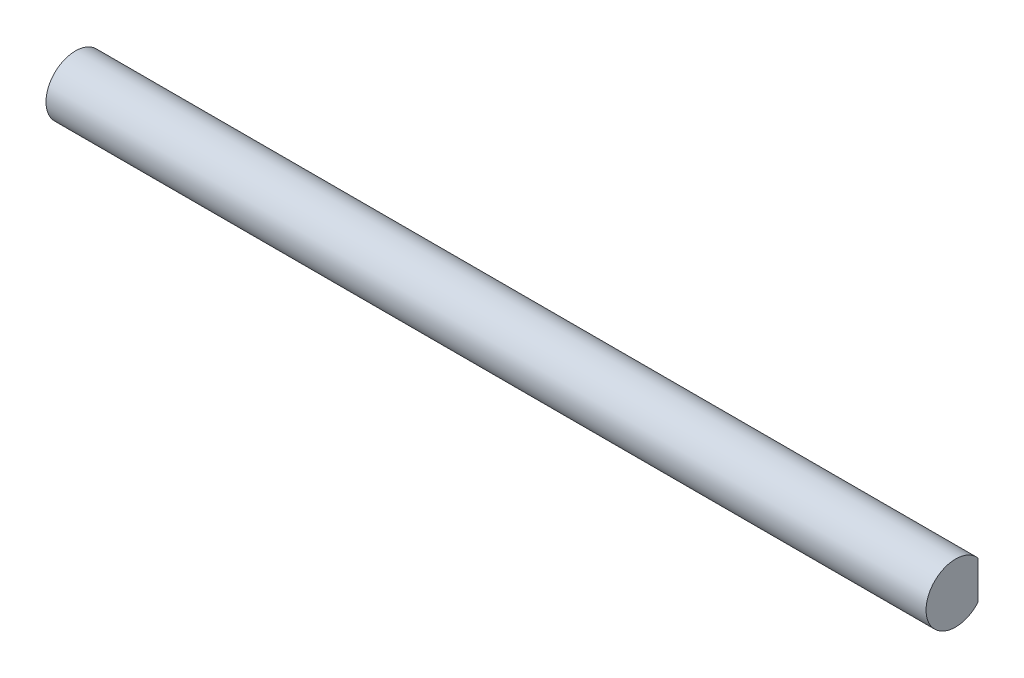
ISO-10303-21;
HEADER;
FILE_DESCRIPTION(('STEP AP214'),'2;1');
FILE_NAME('part.step','',(''),(''),'','','');
FILE_SCHEMA(('AUTOMOTIVE_DESIGN { 1 0 10303 214 1 1 1 1 }'));
ENDSEC;
DATA;
#1=APPLICATION_CONTEXT('core data for automotive mechanical design processes');
#2=APPLICATION_PROTOCOL_DEFINITION('international standard','automotive_design',2000,#1);
#3=PRODUCT_CONTEXT('',#1,'mechanical');
#4=PRODUCT('Part','Part','',(#3));
#5=PRODUCT_RELATED_PRODUCT_CATEGORY('part','',(#4));
#6=PRODUCT_DEFINITION_FORMATION('','',#4);
#7=PRODUCT_DEFINITION_CONTEXT('part definition',#1,'design');
#8=PRODUCT_DEFINITION('design','',#6,#7);
#9=PRODUCT_DEFINITION_SHAPE('','',#8);
#10=(LENGTH_UNIT() NAMED_UNIT(*) SI_UNIT(.MILLI.,.METRE.));
#11=(NAMED_UNIT(*) PLANE_ANGLE_UNIT() SI_UNIT($,.RADIAN.));
#12=(NAMED_UNIT(*) SI_UNIT($,.STERADIAN.) SOLID_ANGLE_UNIT());
#13=UNCERTAINTY_MEASURE_WITH_UNIT(LENGTH_MEASURE(1.E-05),#10,'distance_accuracy_value','');
#14=(GEOMETRIC_REPRESENTATION_CONTEXT(3) GLOBAL_UNCERTAINTY_ASSIGNED_CONTEXT((#13)) GLOBAL_UNIT_ASSIGNED_CONTEXT((#10,
#11,#12)) REPRESENTATION_CONTEXT('',''));
#15=CARTESIAN_POINT('',(0.,0.,0.));
#16=DIRECTION('',(0.,0.,1.));
#17=DIRECTION('',(1.,0.,0.));
#18=AXIS2_PLACEMENT_3D('',#15,#16,#17);
#19=CARTESIAN_POINT('',(85.,0.,0.));
#20=DIRECTION('',(-1.,0.,0.));
#21=DIRECTION('',(0.,0.,1.));
#22=AXIS2_PLACEMENT_3D('',#19,#20,#21);
#23=CYLINDRICAL_SURFACE('',#22,2.85);
#24=CARTESIAN_POINT('',(0.,0.,0.));
#25=DIRECTION('',(1.,0.,0.));
#26=DIRECTION('',(0.,0.,-1.));
#27=AXIS2_PLACEMENT_3D('',#24,#25,#26);
#28=CIRCLE('',#27,2.85);
#29=CARTESIAN_POINT('',(0.,1.85,-2.16794833886788));
#30=VERTEX_POINT('',#29);
#31=CARTESIAN_POINT('',(0.,-1.85,-2.16794833886788));
#32=VERTEX_POINT('',#31);
#33=EDGE_CURVE('E65',#30,#32,#28,.T.);
#34=ORIENTED_EDGE('',*,*,#33,.T.);
#35=DIRECTION('',(-1.,0.,0.));
#36=VECTOR('',#35,1.);
#37=CARTESIAN_POINT('',(85.,-1.85,-2.16794833886788));
#38=LINE('',#37,#36);
#39=CARTESIAN_POINT('',(85.,-1.85,-2.16794833886788));
#40=VERTEX_POINT('',#39);
#41=EDGE_CURVE('E11',#40,#32,#38,.T.);
#42=ORIENTED_EDGE('',*,*,#41,.F.);
#43=CARTESIAN_POINT('',(85.,0.,0.));
#44=DIRECTION('',(1.,0.,0.));
#45=DIRECTION('',(0.,0.,-1.));
#46=AXIS2_PLACEMENT_3D('',#43,#44,#45);
#47=CIRCLE('',#46,2.85);
#48=CARTESIAN_POINT('',(85.,1.85,-2.16794833886788));
#49=VERTEX_POINT('',#48);
#50=EDGE_CURVE('E64',#49,#40,#47,.T.);
#51=ORIENTED_EDGE('',*,*,#50,.F.);
#52=DIRECTION('',(-1.,0.,0.));
#53=VECTOR('',#52,1.);
#54=CARTESIAN_POINT('',(85.,1.85,-2.16794833886788));
#55=LINE('',#54,#53);
#56=EDGE_CURVE('E42',#49,#30,#55,.T.);
#57=ORIENTED_EDGE('',*,*,#56,.T.);
#58=EDGE_LOOP('',(#34,#42,#51,#57));
#59=FACE_BOUND('',#58,.T.);
#60=ADVANCED_FACE('F34',(#59),#23,.T.);
#61=CARTESIAN_POINT('',(85.,1.85,-2.16794833886788));
#62=DIRECTION('',(0.,0.,1.));
#63=DIRECTION('',(1.,0.,0.));
#64=AXIS2_PLACEMENT_3D('',#61,#62,#63);
#65=PLANE('',#64);
#66=DIRECTION('',(0.,1.,0.));
#67=VECTOR('',#66,1.);
#68=CARTESIAN_POINT('',(0.,1.85,-2.16794833886788));
#69=LINE('',#68,#67);
#70=EDGE_CURVE('E57',#32,#30,#69,.T.);
#71=ORIENTED_EDGE('',*,*,#70,.T.);
#72=ORIENTED_EDGE('',*,*,#56,.F.);
#73=DIRECTION('',(0.,1.,0.));
#74=VECTOR('',#73,1.);
#75=CARTESIAN_POINT('',(85.,1.85,-2.16794833886788));
#76=LINE('',#75,#74);
#77=EDGE_CURVE('E49',#40,#49,#76,.T.);
#78=ORIENTED_EDGE('',*,*,#77,.F.);
#79=ORIENTED_EDGE('',*,*,#41,.T.);
#80=EDGE_LOOP('',(#71,#72,#78,#79));
#81=FACE_BOUND('',#80,.T.);
#82=ADVANCED_FACE('F60',(#81),#65,.F.);
#83=CARTESIAN_POINT('',(85.,0.,0.));
#84=DIRECTION('',(1.,0.,0.));
#85=DIRECTION('',(0.,0.,-1.));
#86=AXIS2_PLACEMENT_3D('',#83,#84,#85);
#87=PLANE('',#86);
#88=ORIENTED_EDGE('',*,*,#50,.T.);
#89=ORIENTED_EDGE('',*,*,#77,.T.);
#90=EDGE_LOOP('',(#88,#89));
#91=FACE_BOUND('',#90,.T.);
#92=ADVANCED_FACE('F72',(#91),#87,.T.);
#93=CARTESIAN_POINT('',(0.,0.,0.));
#94=DIRECTION('',(1.,0.,0.));
#95=DIRECTION('',(0.,0.,-1.));
#96=AXIS2_PLACEMENT_3D('',#93,#94,#95);
#97=PLANE('',#96);
#98=ORIENTED_EDGE('',*,*,#33,.F.);
#99=ORIENTED_EDGE('',*,*,#70,.F.);
#100=EDGE_LOOP('',(#98,#99));
#101=FACE_BOUND('',#100,.T.);
#102=ADVANCED_FACE('F68',(#101),#97,.F.);
#103=CLOSED_SHELL('',(#60,#82,#92,#102));
#104=MANIFOLD_SOLID_BREP('B2',#103);
#105=ADVANCED_BREP_SHAPE_REPRESENTATION('',(#18,#104),#14);
#106=SHAPE_DEFINITION_REPRESENTATION(#9,#105);
ENDSEC;
END-ISO-10303-21;
